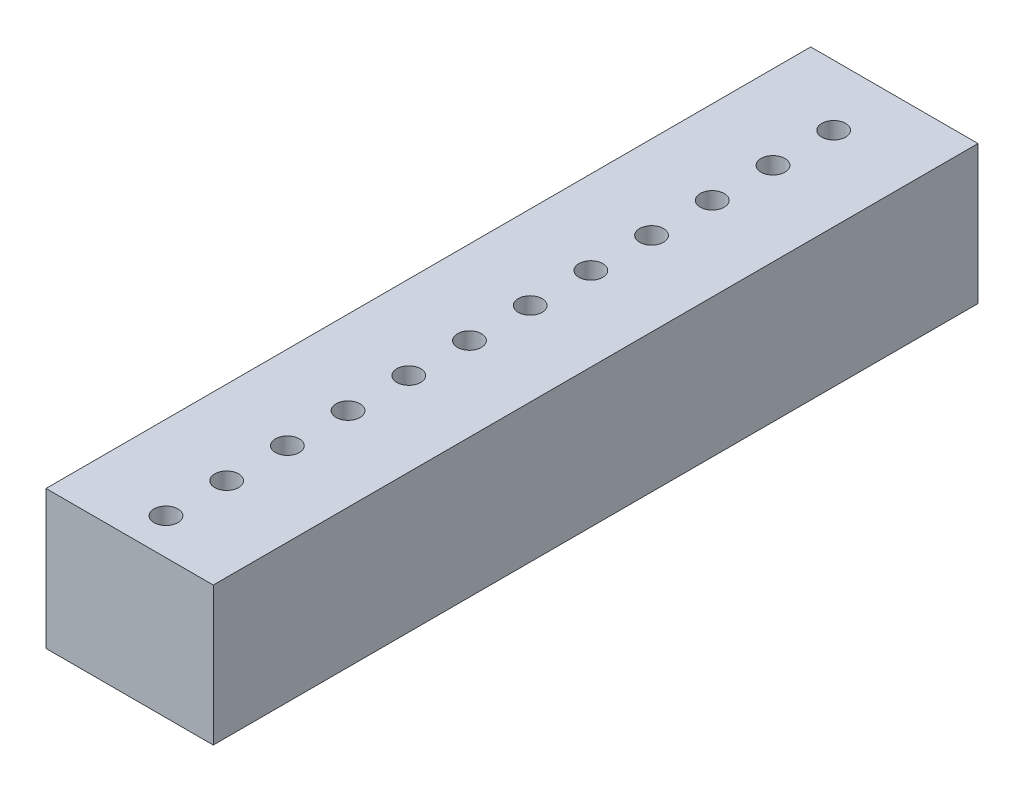
ISO-10303-21;
HEADER;
FILE_DESCRIPTION(('STEP AP214'),'2;1');
FILE_NAME('part.step','',(''),(''),'','','');
FILE_SCHEMA(('AUTOMOTIVE_DESIGN { 1 0 10303 214 1 1 1 1 }'));
ENDSEC;
DATA;
#1=APPLICATION_CONTEXT('core data for automotive mechanical design processes');
#2=APPLICATION_PROTOCOL_DEFINITION('international standard','automotive_design',2000,#1);
#3=PRODUCT_CONTEXT('',#1,'mechanical');
#4=PRODUCT('Part','Part','',(#3));
#5=PRODUCT_RELATED_PRODUCT_CATEGORY('part','',(#4));
#6=PRODUCT_DEFINITION_FORMATION('','',#4);
#7=PRODUCT_DEFINITION_CONTEXT('part definition',#1,'design');
#8=PRODUCT_DEFINITION('design','',#6,#7);
#9=PRODUCT_DEFINITION_SHAPE('','',#8);
#10=(LENGTH_UNIT() NAMED_UNIT(*) SI_UNIT(.MILLI.,.METRE.));
#11=(NAMED_UNIT(*) PLANE_ANGLE_UNIT() SI_UNIT($,.RADIAN.));
#12=(NAMED_UNIT(*) SI_UNIT($,.STERADIAN.) SOLID_ANGLE_UNIT());
#13=UNCERTAINTY_MEASURE_WITH_UNIT(LENGTH_MEASURE(1.E-05),#10,'distance_accuracy_value','');
#14=(GEOMETRIC_REPRESENTATION_CONTEXT(3) GLOBAL_UNCERTAINTY_ASSIGNED_CONTEXT((#13)) GLOBAL_UNIT_ASSIGNED_CONTEXT((#10,
#11,#12)) REPRESENTATION_CONTEXT('',''));
#15=CARTESIAN_POINT('',(0.,0.,0.));
#16=DIRECTION('',(0.,0.,1.));
#17=DIRECTION('',(1.,0.,0.));
#18=AXIS2_PLACEMENT_3D('',#15,#16,#17);
#19=CARTESIAN_POINT('',(0.,-2.9,14.48));
#20=DIRECTION('',(0.,1.,0.));
#21=DIRECTION('',(0.,0.,1.));
#22=AXIS2_PLACEMENT_3D('',#19,#20,#21);
#23=CYLINDRICAL_SURFACE('',#22,0.5);
#24=CARTESIAN_POINT('',(0.,-2.9,14.48));
#25=DIRECTION('',(0.,1.,0.));
#26=DIRECTION('',(0.,0.,1.));
#27=AXIS2_PLACEMENT_3D('',#24,#25,#26);
#28=CIRCLE('',#27,0.5);
#29=CARTESIAN_POINT('',(0.,-2.9,14.98));
#30=VERTEX_POINT('',#29);
#31=EDGE_CURVE('E41',#30,#30,#28,.T.);
#32=ORIENTED_EDGE('',*,*,#31,.F.);
#33=EDGE_LOOP('',(#32));
#34=FACE_BOUND('',#33,.T.);
#35=CARTESIAN_POINT('',(0.,2.9,14.48));
#36=DIRECTION('',(0.,1.,0.));
#37=DIRECTION('',(0.,0.,1.));
#38=AXIS2_PLACEMENT_3D('',#35,#36,#37);
#39=CIRCLE('',#38,0.5);
#40=CARTESIAN_POINT('',(0.,2.9,14.98));
#41=VERTEX_POINT('',#40);
#42=EDGE_CURVE('E11',#41,#41,#39,.T.);
#43=ORIENTED_EDGE('',*,*,#42,.T.);
#44=EDGE_LOOP('',(#43));
#45=FACE_BOUND('',#44,.T.);
#46=ADVANCED_FACE('F33',(#34,#45),#23,.F.);
#47=CARTESIAN_POINT('',(0.,-2.9,11.94));
#48=DIRECTION('',(0.,1.,0.));
#49=DIRECTION('',(0.,0.,1.));
#50=AXIS2_PLACEMENT_3D('',#47,#48,#49);
#51=CYLINDRICAL_SURFACE('',#50,0.5);
#52=CARTESIAN_POINT('',(0.,-2.9,11.94));
#53=DIRECTION('',(0.,1.,0.));
#54=DIRECTION('',(0.,0.,1.));
#55=AXIS2_PLACEMENT_3D('',#52,#53,#54);
#56=CIRCLE('',#55,0.5);
#57=CARTESIAN_POINT('',(0.,-2.9,12.44));
#58=VERTEX_POINT('',#57);
#59=EDGE_CURVE('E162',#58,#58,#56,.T.);
#60=ORIENTED_EDGE('',*,*,#59,.F.);
#61=EDGE_LOOP('',(#60));
#62=FACE_BOUND('',#61,.T.);
#63=CARTESIAN_POINT('',(0.,2.9,11.94));
#64=DIRECTION('',(0.,1.,0.));
#65=DIRECTION('',(0.,0.,1.));
#66=AXIS2_PLACEMENT_3D('',#63,#64,#65);
#67=CIRCLE('',#66,0.5);
#68=CARTESIAN_POINT('',(0.,2.9,12.44));
#69=VERTEX_POINT('',#68);
#70=EDGE_CURVE('E165',#69,#69,#67,.T.);
#71=ORIENTED_EDGE('',*,*,#70,.T.);
#72=EDGE_LOOP('',(#71));
#73=FACE_BOUND('',#72,.T.);
#74=ADVANCED_FACE('F174',(#62,#73),#51,.F.);
#75=CARTESIAN_POINT('',(0.,-2.9,9.4));
#76=DIRECTION('',(0.,1.,0.));
#77=DIRECTION('',(0.,0.,1.));
#78=AXIS2_PLACEMENT_3D('',#75,#76,#77);
#79=CYLINDRICAL_SURFACE('',#78,0.5);
#80=CARTESIAN_POINT('',(0.,-2.9,9.4));
#81=DIRECTION('',(0.,1.,0.));
#82=DIRECTION('',(0.,0.,1.));
#83=AXIS2_PLACEMENT_3D('',#80,#81,#82);
#84=CIRCLE('',#83,0.5);
#85=CARTESIAN_POINT('',(0.,-2.9,9.9));
#86=VERTEX_POINT('',#85);
#87=EDGE_CURVE('E156',#86,#86,#84,.T.);
#88=ORIENTED_EDGE('',*,*,#87,.F.);
#89=EDGE_LOOP('',(#88));
#90=FACE_BOUND('',#89,.T.);
#91=CARTESIAN_POINT('',(0.,2.9,9.4));
#92=DIRECTION('',(0.,1.,0.));
#93=DIRECTION('',(0.,0.,1.));
#94=AXIS2_PLACEMENT_3D('',#91,#92,#93);
#95=CIRCLE('',#94,0.5);
#96=CARTESIAN_POINT('',(0.,2.9,9.9));
#97=VERTEX_POINT('',#96);
#98=EDGE_CURVE('E159',#97,#97,#95,.T.);
#99=ORIENTED_EDGE('',*,*,#98,.T.);
#100=EDGE_LOOP('',(#99));
#101=FACE_BOUND('',#100,.T.);
#102=ADVANCED_FACE('F228',(#90,#101),#79,.F.);
#103=CARTESIAN_POINT('',(0.,-2.9,6.86));
#104=DIRECTION('',(0.,1.,0.));
#105=DIRECTION('',(0.,0.,1.));
#106=AXIS2_PLACEMENT_3D('',#103,#104,#105);
#107=CYLINDRICAL_SURFACE('',#106,0.5);
#108=CARTESIAN_POINT('',(0.,-2.9,6.86));
#109=DIRECTION('',(0.,1.,0.));
#110=DIRECTION('',(0.,0.,1.));
#111=AXIS2_PLACEMENT_3D('',#108,#109,#110);
#112=CIRCLE('',#111,0.5);
#113=CARTESIAN_POINT('',(0.,-2.9,7.36));
#114=VERTEX_POINT('',#113);
#115=EDGE_CURVE('E150',#114,#114,#112,.T.);
#116=ORIENTED_EDGE('',*,*,#115,.F.);
#117=EDGE_LOOP('',(#116));
#118=FACE_BOUND('',#117,.T.);
#119=CARTESIAN_POINT('',(0.,2.9,6.86));
#120=DIRECTION('',(0.,1.,0.));
#121=DIRECTION('',(0.,0.,1.));
#122=AXIS2_PLACEMENT_3D('',#119,#120,#121);
#123=CIRCLE('',#122,0.5);
#124=CARTESIAN_POINT('',(0.,2.9,7.36));
#125=VERTEX_POINT('',#124);
#126=EDGE_CURVE('E153',#125,#125,#123,.T.);
#127=ORIENTED_EDGE('',*,*,#126,.T.);
#128=EDGE_LOOP('',(#127));
#129=FACE_BOUND('',#128,.T.);
#130=ADVANCED_FACE('F224',(#118,#129),#107,.F.);
#131=CARTESIAN_POINT('',(0.,-2.9,4.32));
#132=DIRECTION('',(0.,1.,0.));
#133=DIRECTION('',(0.,0.,1.));
#134=AXIS2_PLACEMENT_3D('',#131,#132,#133);
#135=CYLINDRICAL_SURFACE('',#134,0.5);
#136=CARTESIAN_POINT('',(0.,-2.9,4.32));
#137=DIRECTION('',(0.,1.,0.));
#138=DIRECTION('',(0.,0.,1.));
#139=AXIS2_PLACEMENT_3D('',#136,#137,#138);
#140=CIRCLE('',#139,0.5);
#141=CARTESIAN_POINT('',(0.,-2.9,4.82));
#142=VERTEX_POINT('',#141);
#143=EDGE_CURVE('E144',#142,#142,#140,.T.);
#144=ORIENTED_EDGE('',*,*,#143,.F.);
#145=EDGE_LOOP('',(#144));
#146=FACE_BOUND('',#145,.T.);
#147=CARTESIAN_POINT('',(0.,2.9,4.32));
#148=DIRECTION('',(0.,1.,0.));
#149=DIRECTION('',(0.,0.,1.));
#150=AXIS2_PLACEMENT_3D('',#147,#148,#149);
#151=CIRCLE('',#150,0.5);
#152=CARTESIAN_POINT('',(0.,2.9,4.82));
#153=VERTEX_POINT('',#152);
#154=EDGE_CURVE('E147',#153,#153,#151,.T.);
#155=ORIENTED_EDGE('',*,*,#154,.T.);
#156=EDGE_LOOP('',(#155));
#157=FACE_BOUND('',#156,.T.);
#158=ADVANCED_FACE('F220',(#146,#157),#135,.F.);
#159=CARTESIAN_POINT('',(0.,-2.9,1.78));
#160=DIRECTION('',(0.,1.,0.));
#161=DIRECTION('',(0.,0.,1.));
#162=AXIS2_PLACEMENT_3D('',#159,#160,#161);
#163=CYLINDRICAL_SURFACE('',#162,0.5);
#164=CARTESIAN_POINT('',(0.,-2.9,1.78));
#165=DIRECTION('',(0.,1.,0.));
#166=DIRECTION('',(0.,0.,1.));
#167=AXIS2_PLACEMENT_3D('',#164,#165,#166);
#168=CIRCLE('',#167,0.5);
#169=CARTESIAN_POINT('',(0.,-2.9,2.28));
#170=VERTEX_POINT('',#169);
#171=EDGE_CURVE('E138',#170,#170,#168,.T.);
#172=ORIENTED_EDGE('',*,*,#171,.F.);
#173=EDGE_LOOP('',(#172));
#174=FACE_BOUND('',#173,.T.);
#175=CARTESIAN_POINT('',(0.,2.9,1.78));
#176=DIRECTION('',(0.,1.,0.));
#177=DIRECTION('',(0.,0.,1.));
#178=AXIS2_PLACEMENT_3D('',#175,#176,#177);
#179=CIRCLE('',#178,0.5);
#180=CARTESIAN_POINT('',(0.,2.9,2.28));
#181=VERTEX_POINT('',#180);
#182=EDGE_CURVE('E141',#181,#181,#179,.T.);
#183=ORIENTED_EDGE('',*,*,#182,.T.);
#184=EDGE_LOOP('',(#183));
#185=FACE_BOUND('',#184,.T.);
#186=ADVANCED_FACE('F216',(#174,#185),#163,.F.);
#187=CARTESIAN_POINT('',(0.,-2.9,-0.759999999999999));
#188=DIRECTION('',(0.,1.,0.));
#189=DIRECTION('',(0.,0.,1.));
#190=AXIS2_PLACEMENT_3D('',#187,#188,#189);
#191=CYLINDRICAL_SURFACE('',#190,0.5);
#192=CARTESIAN_POINT('',(0.,-2.9,-0.759999999999999));
#193=DIRECTION('',(0.,1.,0.));
#194=DIRECTION('',(0.,0.,1.));
#195=AXIS2_PLACEMENT_3D('',#192,#193,#194);
#196=CIRCLE('',#195,0.5);
#197=CARTESIAN_POINT('',(0.,-2.9,-0.259999999999998));
#198=VERTEX_POINT('',#197);
#199=EDGE_CURVE('E132',#198,#198,#196,.T.);
#200=ORIENTED_EDGE('',*,*,#199,.F.);
#201=EDGE_LOOP('',(#200));
#202=FACE_BOUND('',#201,.T.);
#203=CARTESIAN_POINT('',(0.,2.9,-0.759999999999999));
#204=DIRECTION('',(0.,1.,0.));
#205=DIRECTION('',(0.,0.,1.));
#206=AXIS2_PLACEMENT_3D('',#203,#204,#205);
#207=CIRCLE('',#206,0.5);
#208=CARTESIAN_POINT('',(0.,2.9,-0.259999999999998));
#209=VERTEX_POINT('',#208);
#210=EDGE_CURVE('E135',#209,#209,#207,.T.);
#211=ORIENTED_EDGE('',*,*,#210,.T.);
#212=EDGE_LOOP('',(#211));
#213=FACE_BOUND('',#212,.T.);
#214=ADVANCED_FACE('F212',(#202,#213),#191,.F.);
#215=CARTESIAN_POINT('',(0.,-2.9,-3.3));
#216=DIRECTION('',(0.,1.,0.));
#217=DIRECTION('',(0.,0.,1.));
#218=AXIS2_PLACEMENT_3D('',#215,#216,#217);
#219=CYLINDRICAL_SURFACE('',#218,0.5);
#220=CARTESIAN_POINT('',(0.,-2.9,-3.3));
#221=DIRECTION('',(0.,1.,0.));
#222=DIRECTION('',(0.,0.,1.));
#223=AXIS2_PLACEMENT_3D('',#220,#221,#222);
#224=CIRCLE('',#223,0.5);
#225=CARTESIAN_POINT('',(0.,-2.9,-2.8));
#226=VERTEX_POINT('',#225);
#227=EDGE_CURVE('E126',#226,#226,#224,.T.);
#228=ORIENTED_EDGE('',*,*,#227,.F.);
#229=EDGE_LOOP('',(#228));
#230=FACE_BOUND('',#229,.T.);
#231=CARTESIAN_POINT('',(0.,2.9,-3.3));
#232=DIRECTION('',(0.,1.,0.));
#233=DIRECTION('',(0.,0.,1.));
#234=AXIS2_PLACEMENT_3D('',#231,#232,#233);
#235=CIRCLE('',#234,0.5);
#236=CARTESIAN_POINT('',(0.,2.9,-2.8));
#237=VERTEX_POINT('',#236);
#238=EDGE_CURVE('E129',#237,#237,#235,.T.);
#239=ORIENTED_EDGE('',*,*,#238,.T.);
#240=EDGE_LOOP('',(#239));
#241=FACE_BOUND('',#240,.T.);
#242=ADVANCED_FACE('F208',(#230,#241),#219,.F.);
#243=CARTESIAN_POINT('',(0.,-2.9,-5.84));
#244=DIRECTION('',(0.,1.,0.));
#245=DIRECTION('',(0.,0.,1.));
#246=AXIS2_PLACEMENT_3D('',#243,#244,#245);
#247=CYLINDRICAL_SURFACE('',#246,0.5);
#248=CARTESIAN_POINT('',(0.,-2.9,-5.84));
#249=DIRECTION('',(0.,1.,0.));
#250=DIRECTION('',(0.,0.,1.));
#251=AXIS2_PLACEMENT_3D('',#248,#249,#250);
#252=CIRCLE('',#251,0.5);
#253=CARTESIAN_POINT('',(0.,-2.9,-5.34));
#254=VERTEX_POINT('',#253);
#255=EDGE_CURVE('E120',#254,#254,#252,.T.);
#256=ORIENTED_EDGE('',*,*,#255,.F.);
#257=EDGE_LOOP('',(#256));
#258=FACE_BOUND('',#257,.T.);
#259=CARTESIAN_POINT('',(0.,2.9,-5.84));
#260=DIRECTION('',(0.,1.,0.));
#261=DIRECTION('',(0.,0.,1.));
#262=AXIS2_PLACEMENT_3D('',#259,#260,#261);
#263=CIRCLE('',#262,0.5);
#264=CARTESIAN_POINT('',(0.,2.9,-5.34));
#265=VERTEX_POINT('',#264);
#266=EDGE_CURVE('E123',#265,#265,#263,.T.);
#267=ORIENTED_EDGE('',*,*,#266,.T.);
#268=EDGE_LOOP('',(#267));
#269=FACE_BOUND('',#268,.T.);
#270=ADVANCED_FACE('F204',(#258,#269),#247,.F.);
#271=CARTESIAN_POINT('',(0.,-2.9,-8.38));
#272=DIRECTION('',(0.,1.,0.));
#273=DIRECTION('',(0.,0.,1.));
#274=AXIS2_PLACEMENT_3D('',#271,#272,#273);
#275=CYLINDRICAL_SURFACE('',#274,0.5);
#276=CARTESIAN_POINT('',(0.,-2.9,-8.38));
#277=DIRECTION('',(0.,1.,0.));
#278=DIRECTION('',(0.,0.,1.));
#279=AXIS2_PLACEMENT_3D('',#276,#277,#278);
#280=CIRCLE('',#279,0.5);
#281=CARTESIAN_POINT('',(0.,-2.9,-7.88));
#282=VERTEX_POINT('',#281);
#283=EDGE_CURVE('E112',#282,#282,#280,.T.);
#284=ORIENTED_EDGE('',*,*,#283,.F.);
#285=EDGE_LOOP('',(#284));
#286=FACE_BOUND('',#285,.T.);
#287=CARTESIAN_POINT('',(0.,2.9,-8.38));
#288=DIRECTION('',(0.,1.,0.));
#289=DIRECTION('',(0.,0.,1.));
#290=AXIS2_PLACEMENT_3D('',#287,#288,#289);
#291=CIRCLE('',#290,0.5);
#292=CARTESIAN_POINT('',(0.,2.9,-7.88));
#293=VERTEX_POINT('',#292);
#294=EDGE_CURVE('E117',#293,#293,#291,.T.);
#295=ORIENTED_EDGE('',*,*,#294,.T.);
#296=EDGE_LOOP('',(#295));
#297=FACE_BOUND('',#296,.T.);
#298=ADVANCED_FACE('F201',(#286,#297),#275,.F.);
#299=CARTESIAN_POINT('',(3.5,2.9,16.));
#300=DIRECTION('',(0.,0.,1.));
#301=DIRECTION('',(1.,0.,0.));
#302=AXIS2_PLACEMENT_3D('',#299,#300,#301);
#303=PLANE('',#302);
#304=DIRECTION('',(-1.,0.,0.));
#305=VECTOR('',#304,1.);
#306=CARTESIAN_POINT('',(3.5,-2.9,16.));
#307=LINE('',#306,#305);
#308=CARTESIAN_POINT('',(3.5,-2.9,16.));
#309=VERTEX_POINT('',#308);
#310=CARTESIAN_POINT('',(-3.5,-2.9,16.));
#311=VERTEX_POINT('',#310);
#312=EDGE_CURVE('E102',#309,#311,#307,.T.);
#313=ORIENTED_EDGE('',*,*,#312,.F.);
#314=DIRECTION('',(0.,-1.,0.));
#315=VECTOR('',#314,1.);
#316=CARTESIAN_POINT('',(3.5,2.9,16.));
#317=LINE('',#316,#315);
#318=CARTESIAN_POINT('',(3.5,2.9,16.));
#319=VERTEX_POINT('',#318);
#320=EDGE_CURVE('E49',#319,#309,#317,.T.);
#321=ORIENTED_EDGE('',*,*,#320,.F.);
#322=DIRECTION('',(-1.,0.,0.));
#323=VECTOR('',#322,1.);
#324=CARTESIAN_POINT('',(3.5,2.9,16.));
#325=LINE('',#324,#323);
#326=CARTESIAN_POINT('',(-3.5,2.9,16.));
#327=VERTEX_POINT('',#326);
#328=EDGE_CURVE('E95',#319,#327,#325,.T.);
#329=ORIENTED_EDGE('',*,*,#328,.T.);
#330=DIRECTION('',(0.,-1.,0.));
#331=VECTOR('',#330,1.);
#332=CARTESIAN_POINT('',(-3.5,2.9,16.));
#333=LINE('',#332,#331);
#334=EDGE_CURVE('E92',#327,#311,#333,.T.);
#335=ORIENTED_EDGE('',*,*,#334,.T.);
#336=EDGE_LOOP('',(#313,#321,#329,#335));
#337=FACE_BOUND('',#336,.T.);
#338=ADVANCED_FACE('F196',(#337),#303,.T.);
#339=CARTESIAN_POINT('',(3.5,2.9,-16.));
#340=DIRECTION('',(1.,0.,0.));
#341=DIRECTION('',(0.,0.,-1.));
#342=AXIS2_PLACEMENT_3D('',#339,#340,#341);
#343=PLANE('',#342);
#344=DIRECTION('',(0.,0.,1.));
#345=VECTOR('',#344,1.);
#346=CARTESIAN_POINT('',(3.5,-2.9,-16.));
#347=LINE('',#346,#345);
#348=CARTESIAN_POINT('',(3.5,-2.9,-16.));
#349=VERTEX_POINT('',#348);
#350=EDGE_CURVE('E97',#349,#309,#347,.T.);
#351=ORIENTED_EDGE('',*,*,#350,.F.);
#352=DIRECTION('',(0.,-1.,0.));
#353=VECTOR('',#352,1.);
#354=CARTESIAN_POINT('',(3.5,2.9,-16.));
#355=LINE('',#354,#353);
#356=CARTESIAN_POINT('',(3.5,2.9,-16.));
#357=VERTEX_POINT('',#356);
#358=EDGE_CURVE('E65',#357,#349,#355,.T.);
#359=ORIENTED_EDGE('',*,*,#358,.F.);
#360=DIRECTION('',(0.,0.,1.));
#361=VECTOR('',#360,1.);
#362=CARTESIAN_POINT('',(3.5,2.9,-16.));
#363=LINE('',#362,#361);
#364=EDGE_CURVE('E83',#357,#319,#363,.T.);
#365=ORIENTED_EDGE('',*,*,#364,.T.);
#366=ORIENTED_EDGE('',*,*,#320,.T.);
#367=EDGE_LOOP('',(#351,#359,#365,#366));
#368=FACE_BOUND('',#367,.T.);
#369=ADVANCED_FACE('F193',(#368),#343,.T.);
#370=CARTESIAN_POINT('',(3.5,2.9,-16.));
#371=DIRECTION('',(0.,0.,1.));
#372=DIRECTION('',(1.,0.,0.));
#373=AXIS2_PLACEMENT_3D('',#370,#371,#372);
#374=PLANE('',#373);
#375=DIRECTION('',(-1.,0.,0.));
#376=VECTOR('',#375,1.);
#377=CARTESIAN_POINT('',(3.5,-2.9,-16.));
#378=LINE('',#377,#376);
#379=CARTESIAN_POINT('',(-3.5,-2.9,-16.));
#380=VERTEX_POINT('',#379);
#381=EDGE_CURVE('E88',#349,#380,#378,.T.);
#382=ORIENTED_EDGE('',*,*,#381,.T.);
#383=DIRECTION('',(0.,-1.,0.));
#384=VECTOR('',#383,1.);
#385=CARTESIAN_POINT('',(-3.5,2.9,-16.));
#386=LINE('',#385,#384);
#387=CARTESIAN_POINT('',(-3.5,2.9,-16.));
#388=VERTEX_POINT('',#387);
#389=EDGE_CURVE('E86',#388,#380,#386,.T.);
#390=ORIENTED_EDGE('',*,*,#389,.F.);
#391=DIRECTION('',(-1.,0.,0.));
#392=VECTOR('',#391,1.);
#393=CARTESIAN_POINT('',(3.5,2.9,-16.));
#394=LINE('',#393,#392);
#395=EDGE_CURVE('E79',#357,#388,#394,.T.);
#396=ORIENTED_EDGE('',*,*,#395,.F.);
#397=ORIENTED_EDGE('',*,*,#358,.T.);
#398=EDGE_LOOP('',(#382,#390,#396,#397));
#399=FACE_BOUND('',#398,.T.);
#400=ADVANCED_FACE('F87',(#399),#374,.F.);
#401=CARTESIAN_POINT('',(-3.5,2.9,-16.));
#402=DIRECTION('',(1.,0.,0.));
#403=DIRECTION('',(0.,0.,-1.));
#404=AXIS2_PLACEMENT_3D('',#401,#402,#403);
#405=PLANE('',#404);
#406=DIRECTION('',(0.,0.,1.));
#407=VECTOR('',#406,1.);
#408=CARTESIAN_POINT('',(-3.5,-2.9,-16.));
#409=LINE('',#408,#407);
#410=EDGE_CURVE('E105',#380,#311,#409,.T.);
#411=ORIENTED_EDGE('',*,*,#410,.T.);
#412=ORIENTED_EDGE('',*,*,#334,.F.);
#413=DIRECTION('',(0.,0.,1.));
#414=VECTOR('',#413,1.);
#415=CARTESIAN_POINT('',(-3.5,2.9,-16.));
#416=LINE('',#415,#414);
#417=EDGE_CURVE('E76',#388,#327,#416,.T.);
#418=ORIENTED_EDGE('',*,*,#417,.F.);
#419=ORIENTED_EDGE('',*,*,#389,.T.);
#420=EDGE_LOOP('',(#411,#412,#418,#419));
#421=FACE_BOUND('',#420,.T.);
#422=ADVANCED_FACE('F94',(#421),#405,.F.);
#423=CARTESIAN_POINT('',(0.,2.9,0.));
#424=DIRECTION('',(0.,1.,0.));
#425=DIRECTION('',(0.,0.,1.));
#426=AXIS2_PLACEMENT_3D('',#423,#424,#425);
#427=PLANE('',#426);
#428=CARTESIAN_POINT('',(0.,2.9,-10.92));
#429=DIRECTION('',(0.,1.,0.));
#430=DIRECTION('',(0.,0.,1.));
#431=AXIS2_PLACEMENT_3D('',#428,#429,#430);
#432=CIRCLE('',#431,0.5);
#433=CARTESIAN_POINT('',(0.,2.9,-10.42));
#434=VERTEX_POINT('',#433);
#435=EDGE_CURVE('E349',#434,#434,#432,.T.);
#436=ORIENTED_EDGE('',*,*,#435,.F.);
#437=EDGE_LOOP('',(#436));
#438=FACE_BOUND('',#437,.T.);
#439=CARTESIAN_POINT('',(0.,2.9,-13.46));
#440=DIRECTION('',(0.,1.,0.));
#441=DIRECTION('',(0.,0.,1.));
#442=AXIS2_PLACEMENT_3D('',#439,#440,#441);
#443=CIRCLE('',#442,0.5);
#444=CARTESIAN_POINT('',(0.,2.9,-12.96));
#445=VERTEX_POINT('',#444);
#446=EDGE_CURVE('E350',#445,#445,#443,.T.);
#447=ORIENTED_EDGE('',*,*,#446,.F.);
#448=EDGE_LOOP('',(#447));
#449=FACE_BOUND('',#448,.T.);
#450=ORIENTED_EDGE('',*,*,#328,.F.);
#451=ORIENTED_EDGE('',*,*,#364,.F.);
#452=ORIENTED_EDGE('',*,*,#395,.T.);
#453=ORIENTED_EDGE('',*,*,#417,.T.);
#454=EDGE_LOOP('',(#450,#451,#452,#453));
#455=FACE_BOUND('',#454,.T.);
#456=ORIENTED_EDGE('',*,*,#294,.F.);
#457=EDGE_LOOP('',(#456));
#458=FACE_BOUND('',#457,.T.);
#459=ORIENTED_EDGE('',*,*,#266,.F.);
#460=EDGE_LOOP('',(#459));
#461=FACE_BOUND('',#460,.T.);
#462=ORIENTED_EDGE('',*,*,#238,.F.);
#463=EDGE_LOOP('',(#462));
#464=FACE_BOUND('',#463,.T.);
#465=ORIENTED_EDGE('',*,*,#210,.F.);
#466=EDGE_LOOP('',(#465));
#467=FACE_BOUND('',#466,.T.);
#468=ORIENTED_EDGE('',*,*,#182,.F.);
#469=EDGE_LOOP('',(#468));
#470=FACE_BOUND('',#469,.T.);
#471=ORIENTED_EDGE('',*,*,#154,.F.);
#472=EDGE_LOOP('',(#471));
#473=FACE_BOUND('',#472,.T.);
#474=ORIENTED_EDGE('',*,*,#126,.F.);
#475=EDGE_LOOP('',(#474));
#476=FACE_BOUND('',#475,.T.);
#477=ORIENTED_EDGE('',*,*,#98,.F.);
#478=EDGE_LOOP('',(#477));
#479=FACE_BOUND('',#478,.T.);
#480=ORIENTED_EDGE('',*,*,#70,.F.);
#481=EDGE_LOOP('',(#480));
#482=FACE_BOUND('',#481,.T.);
#483=ORIENTED_EDGE('',*,*,#42,.F.);
#484=EDGE_LOOP('',(#483));
#485=FACE_BOUND('',#484,.T.);
#486=ADVANCED_FACE('F81',(#438,#449,#455,#458,#461,#464,#467,#470,#473,#476,#479,#482,#485),
#427,.T.);
#487=CARTESIAN_POINT('',(0.,-2.9,0.));
#488=DIRECTION('',(0.,1.,0.));
#489=DIRECTION('',(0.,0.,1.));
#490=AXIS2_PLACEMENT_3D('',#487,#488,#489);
#491=PLANE('',#490);
#492=CARTESIAN_POINT('',(0.,-2.9,-10.92));
#493=DIRECTION('',(0.,1.,0.));
#494=DIRECTION('',(0.,0.,1.));
#495=AXIS2_PLACEMENT_3D('',#492,#493,#494);
#496=CIRCLE('',#495,0.5);
#497=CARTESIAN_POINT('',(0.,-2.9,-10.42));
#498=VERTEX_POINT('',#497);
#499=EDGE_CURVE('E347',#498,#498,#496,.T.);
#500=ORIENTED_EDGE('',*,*,#499,.T.);
#501=EDGE_LOOP('',(#500));
#502=FACE_BOUND('',#501,.T.);
#503=CARTESIAN_POINT('',(0.,-2.9,-13.46));
#504=DIRECTION('',(0.,1.,0.));
#505=DIRECTION('',(0.,0.,1.));
#506=AXIS2_PLACEMENT_3D('',#503,#504,#505);
#507=CIRCLE('',#506,0.5);
#508=CARTESIAN_POINT('',(0.,-2.9,-12.96));
#509=VERTEX_POINT('',#508);
#510=EDGE_CURVE('E106',#509,#509,#507,.T.);
#511=ORIENTED_EDGE('',*,*,#510,.T.);
#512=EDGE_LOOP('',(#511));
#513=FACE_BOUND('',#512,.T.);
#514=ORIENTED_EDGE('',*,*,#312,.T.);
#515=ORIENTED_EDGE('',*,*,#410,.F.);
#516=ORIENTED_EDGE('',*,*,#381,.F.);
#517=ORIENTED_EDGE('',*,*,#350,.T.);
#518=EDGE_LOOP('',(#514,#515,#516,#517));
#519=FACE_BOUND('',#518,.T.);
#520=ORIENTED_EDGE('',*,*,#283,.T.);
#521=EDGE_LOOP('',(#520));
#522=FACE_BOUND('',#521,.T.);
#523=ORIENTED_EDGE('',*,*,#255,.T.);
#524=EDGE_LOOP('',(#523));
#525=FACE_BOUND('',#524,.T.);
#526=ORIENTED_EDGE('',*,*,#227,.T.);
#527=EDGE_LOOP('',(#526));
#528=FACE_BOUND('',#527,.T.);
#529=ORIENTED_EDGE('',*,*,#199,.T.);
#530=EDGE_LOOP('',(#529));
#531=FACE_BOUND('',#530,.T.);
#532=ORIENTED_EDGE('',*,*,#171,.T.);
#533=EDGE_LOOP('',(#532));
#534=FACE_BOUND('',#533,.T.);
#535=ORIENTED_EDGE('',*,*,#143,.T.);
#536=EDGE_LOOP('',(#535));
#537=FACE_BOUND('',#536,.T.);
#538=ORIENTED_EDGE('',*,*,#115,.T.);
#539=EDGE_LOOP('',(#538));
#540=FACE_BOUND('',#539,.T.);
#541=ORIENTED_EDGE('',*,*,#87,.T.);
#542=EDGE_LOOP('',(#541));
#543=FACE_BOUND('',#542,.T.);
#544=ORIENTED_EDGE('',*,*,#59,.T.);
#545=EDGE_LOOP('',(#544));
#546=FACE_BOUND('',#545,.T.);
#547=ORIENTED_EDGE('',*,*,#31,.T.);
#548=EDGE_LOOP('',(#547));
#549=FACE_BOUND('',#548,.T.);
#550=ADVANCED_FACE('F170',(#502,#513,#519,#522,#525,#528,#531,#534,#537,#540,#543,#546,#549),
#491,.F.);
#551=CARTESIAN_POINT('',(0.,-2.9,-13.46));
#552=DIRECTION('',(0.,1.,0.));
#553=DIRECTION('',(0.,0.,1.));
#554=AXIS2_PLACEMENT_3D('',#551,#552,#553);
#555=CYLINDRICAL_SURFACE('',#554,0.5);
#556=ORIENTED_EDGE('',*,*,#510,.F.);
#557=EDGE_LOOP('',(#556));
#558=FACE_BOUND('',#557,.T.);
#559=ORIENTED_EDGE('',*,*,#446,.T.);
#560=EDGE_LOOP('',(#559));
#561=FACE_BOUND('',#560,.T.);
#562=ADVANCED_FACE('F184',(#558,#561),#555,.F.);
#563=CARTESIAN_POINT('',(0.,-2.9,-10.92));
#564=DIRECTION('',(0.,1.,0.));
#565=DIRECTION('',(0.,0.,1.));
#566=AXIS2_PLACEMENT_3D('',#563,#564,#565);
#567=CYLINDRICAL_SURFACE('',#566,0.5);
#568=ORIENTED_EDGE('',*,*,#499,.F.);
#569=EDGE_LOOP('',(#568));
#570=FACE_BOUND('',#569,.T.);
#571=ORIENTED_EDGE('',*,*,#435,.T.);
#572=EDGE_LOOP('',(#571));
#573=FACE_BOUND('',#572,.T.);
#574=ADVANCED_FACE('F300',(#570,#573),#567,.F.);
#575=CLOSED_SHELL('',(#46,#74,#102,#130,#158,#186,#214,#242,#270,#298,#338,#369,#400,#422,#486,
#550,#562,#574));
#576=MANIFOLD_SOLID_BREP('B2',#575);
#577=ADVANCED_BREP_SHAPE_REPRESENTATION('',(#18,#576),#14);
#578=SHAPE_DEFINITION_REPRESENTATION(#9,#577);
ENDSEC;
END-ISO-10303-21;
